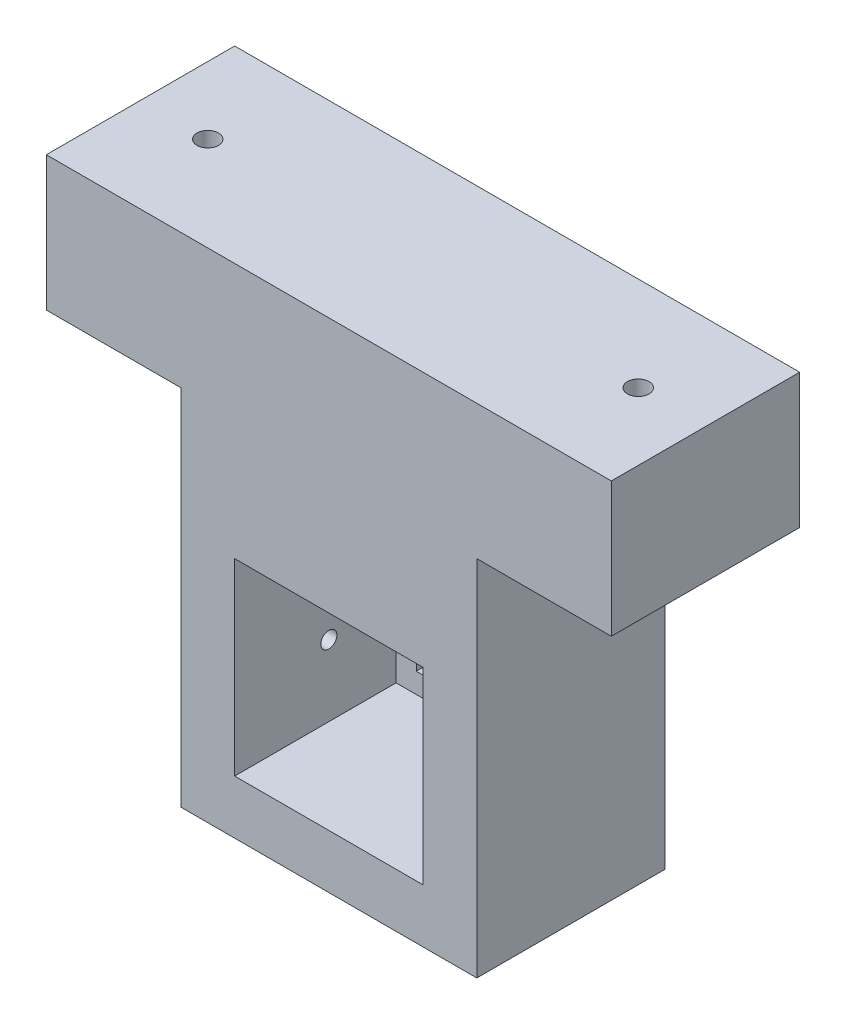
ISO-10303-21;
HEADER;
FILE_DESCRIPTION(('STEP AP214'),'2;1');
FILE_NAME('part.step','',(''),(''),'','','');
FILE_SCHEMA(('AUTOMOTIVE_DESIGN { 1 0 10303 214 1 1 1 1 }'));
ENDSEC;
DATA;
#1=APPLICATION_CONTEXT('core data for automotive mechanical design processes');
#2=APPLICATION_PROTOCOL_DEFINITION('international standard','automotive_design',2000,#1);
#3=PRODUCT_CONTEXT('',#1,'mechanical');
#4=PRODUCT('Part','Part','',(#3));
#5=PRODUCT_RELATED_PRODUCT_CATEGORY('part','',(#4));
#6=PRODUCT_DEFINITION_FORMATION('','',#4);
#7=PRODUCT_DEFINITION_CONTEXT('part definition',#1,'design');
#8=PRODUCT_DEFINITION('design','',#6,#7);
#9=PRODUCT_DEFINITION_SHAPE('','',#8);
#10=(LENGTH_UNIT() NAMED_UNIT(*) SI_UNIT(.MILLI.,.METRE.));
#11=(NAMED_UNIT(*) PLANE_ANGLE_UNIT() SI_UNIT($,.RADIAN.));
#12=(NAMED_UNIT(*) SI_UNIT($,.STERADIAN.) SOLID_ANGLE_UNIT());
#13=UNCERTAINTY_MEASURE_WITH_UNIT(LENGTH_MEASURE(1.E-05),#10,'distance_accuracy_value','');
#14=(GEOMETRIC_REPRESENTATION_CONTEXT(3) GLOBAL_UNCERTAINTY_ASSIGNED_CONTEXT((#13)) GLOBAL_UNIT_ASSIGNED_CONTEXT((#10,
#11,#12)) REPRESENTATION_CONTEXT('',''));
#15=CARTESIAN_POINT('',(0.,0.,0.));
#16=DIRECTION('',(0.,0.,1.));
#17=DIRECTION('',(1.,0.,0.));
#18=AXIS2_PLACEMENT_3D('',#15,#16,#17);
#19=CARTESIAN_POINT('',(0.,0.,7.));
#20=DIRECTION('',(1.,0.,0.));
#21=DIRECTION('',(0.,0.,-1.));
#22=AXIS2_PLACEMENT_3D('',#19,#20,#21);
#23=PLANE('',#22);
#24=CARTESIAN_POINT('',(0.,4.64002852368139,3.5));
#25=DIRECTION('',(-1.,0.,0.));
#26=DIRECTION('',(0.,0.,1.));
#27=AXIS2_PLACEMENT_3D('',#24,#25,#26);
#28=CIRCLE('',#27,0.3);
#29=CARTESIAN_POINT('',(0.,4.64002852368139,3.8));
#30=VERTEX_POINT('',#29);
#31=EDGE_CURVE('E192',#30,#30,#28,.T.);
#32=ORIENTED_EDGE('',*,*,#31,.F.);
#33=EDGE_LOOP('',(#32));
#34=FACE_BOUND('',#33,.T.);
#35=DIRECTION('',(0.,0.,1.));
#36=VECTOR('',#35,1.);
#37=CARTESIAN_POINT('',(0.,13.5,0.));
#38=LINE('',#37,#36);
#39=CARTESIAN_POINT('',(0.,13.5,0.));
#40=VERTEX_POINT('',#39);
#41=CARTESIAN_POINT('',(0.,13.5,7.));
#42=VERTEX_POINT('',#41);
#43=EDGE_CURVE('E49',#40,#42,#38,.T.);
#44=ORIENTED_EDGE('',*,*,#43,.F.);
#45=DIRECTION('',(0.,-1.,0.));
#46=VECTOR('',#45,1.);
#47=CARTESIAN_POINT('',(0.,0.,0.));
#48=LINE('',#47,#46);
#49=CARTESIAN_POINT('',(0.,0.,0.));
#50=VERTEX_POINT('',#49);
#51=EDGE_CURVE('E169',#40,#50,#48,.T.);
#52=ORIENTED_EDGE('',*,*,#51,.T.);
#53=DIRECTION('',(0.,0.,-1.));
#54=VECTOR('',#53,1.);
#55=CARTESIAN_POINT('',(0.,0.,7.));
#56=LINE('',#55,#54);
#57=CARTESIAN_POINT('',(0.,0.,7.));
#58=VERTEX_POINT('',#57);
#59=EDGE_CURVE('E268',#58,#50,#56,.T.);
#60=ORIENTED_EDGE('',*,*,#59,.F.);
#61=DIRECTION('',(0.,-1.,0.));
#62=VECTOR('',#61,1.);
#63=CARTESIAN_POINT('',(0.,0.,7.));
#64=LINE('',#63,#62);
#65=EDGE_CURVE('E250',#42,#58,#64,.T.);
#66=ORIENTED_EDGE('',*,*,#65,.F.);
#67=EDGE_LOOP('',(#44,#52,#60,#66));
#68=FACE_BOUND('',#67,.T.);
#69=ADVANCED_FACE('F33',(#34,#68),#23,.F.);
#70=CARTESIAN_POINT('',(11.,0.,7.));
#71=DIRECTION('',(-1.,0.,0.));
#72=DIRECTION('',(0.,0.,1.));
#73=AXIS2_PLACEMENT_3D('',#70,#71,#72);
#74=PLANE('',#73);
#75=DIRECTION('',(0.,0.,-1.));
#76=VECTOR('',#75,1.);
#77=CARTESIAN_POINT('',(11.,13.5,7.));
#78=LINE('',#77,#76);
#79=CARTESIAN_POINT('',(11.,13.5,7.));
#80=VERTEX_POINT('',#79);
#81=CARTESIAN_POINT('',(11.,13.5,0.));
#82=VERTEX_POINT('',#81);
#83=EDGE_CURVE('E57',#80,#82,#78,.T.);
#84=ORIENTED_EDGE('',*,*,#83,.F.);
#85=DIRECTION('',(0.,1.,0.));
#86=VECTOR('',#85,1.);
#87=CARTESIAN_POINT('',(11.,0.,7.));
#88=LINE('',#87,#86);
#89=CARTESIAN_POINT('',(11.,0.,7.));
#90=VERTEX_POINT('',#89);
#91=EDGE_CURVE('E255',#90,#80,#88,.T.);
#92=ORIENTED_EDGE('',*,*,#91,.F.);
#93=DIRECTION('',(0.,0.,-1.));
#94=VECTOR('',#93,1.);
#95=CARTESIAN_POINT('',(11.,0.,7.));
#96=LINE('',#95,#94);
#97=CARTESIAN_POINT('',(11.,0.,0.));
#98=VERTEX_POINT('',#97);
#99=EDGE_CURVE('E259',#90,#98,#96,.T.);
#100=ORIENTED_EDGE('',*,*,#99,.T.);
#101=DIRECTION('',(0.,1.,0.));
#102=VECTOR('',#101,1.);
#103=CARTESIAN_POINT('',(11.,0.,0.));
#104=LINE('',#103,#102);
#105=EDGE_CURVE('E263',#98,#82,#104,.T.);
#106=ORIENTED_EDGE('',*,*,#105,.T.);
#107=EDGE_LOOP('',(#84,#92,#100,#106));
#108=FACE_BOUND('',#107,.T.);
#109=ADVANCED_FACE('F306',(#108),#74,.F.);
#110=CARTESIAN_POINT('',(0.,0.,7.));
#111=DIRECTION('',(0.,1.,0.));
#112=DIRECTION('',(0.,0.,1.));
#113=AXIS2_PLACEMENT_3D('',#110,#111,#112);
#114=PLANE('',#113);
#115=DIRECTION('',(1.,0.,0.));
#116=VECTOR('',#115,1.);
#117=CARTESIAN_POINT('',(0.,0.,0.));
#118=LINE('',#117,#116);
#119=EDGE_CURVE('E261',#50,#98,#118,.T.);
#120=ORIENTED_EDGE('',*,*,#119,.T.);
#121=ORIENTED_EDGE('',*,*,#99,.F.);
#122=DIRECTION('',(1.,0.,0.));
#123=VECTOR('',#122,1.);
#124=CARTESIAN_POINT('',(0.,0.,7.));
#125=LINE('',#124,#123);
#126=EDGE_CURVE('E252',#58,#90,#125,.T.);
#127=ORIENTED_EDGE('',*,*,#126,.F.);
#128=ORIENTED_EDGE('',*,*,#59,.T.);
#129=EDGE_LOOP('',(#120,#121,#127,#128));
#130=FACE_BOUND('',#129,.T.);
#131=ADVANCED_FACE('F309',(#130),#114,.F.);
#132=CARTESIAN_POINT('',(0.,18.5,7.));
#133=DIRECTION('',(0.,-1.,0.));
#134=DIRECTION('',(0.,0.,-1.));
#135=AXIS2_PLACEMENT_3D('',#132,#133,#134);
#136=PLANE('',#135);
#137=CARTESIAN_POINT('',(-2.5,18.5,3.5));
#138=DIRECTION('',(0.,1.,0.));
#139=DIRECTION('',(0.,0.,1.));
#140=AXIS2_PLACEMENT_3D('',#137,#138,#139);
#141=CIRCLE('',#140,0.4);
#142=CARTESIAN_POINT('',(-2.5,18.5,3.9));
#143=VERTEX_POINT('',#142);
#144=EDGE_CURVE('E278',#143,#143,#141,.T.);
#145=ORIENTED_EDGE('',*,*,#144,.F.);
#146=EDGE_LOOP('',(#145));
#147=FACE_BOUND('',#146,.T.);
#148=CARTESIAN_POINT('',(13.5,18.5,3.5));
#149=DIRECTION('',(0.,1.,0.));
#150=DIRECTION('',(0.,0.,1.));
#151=AXIS2_PLACEMENT_3D('',#148,#149,#150);
#152=CIRCLE('',#151,0.399999999999999);
#153=CARTESIAN_POINT('',(13.5,18.5,3.9));
#154=VERTEX_POINT('',#153);
#155=EDGE_CURVE('E283',#154,#154,#152,.T.);
#156=ORIENTED_EDGE('',*,*,#155,.F.);
#157=EDGE_LOOP('',(#156));
#158=FACE_BOUND('',#157,.T.);
#159=DIRECTION('',(-1.,0.,0.));
#160=VECTOR('',#159,1.);
#161=CARTESIAN_POINT('',(0.,18.5,0.));
#162=LINE('',#161,#160);
#163=CARTESIAN_POINT('',(16.,18.5,0.));
#164=VERTEX_POINT('',#163);
#165=CARTESIAN_POINT('',(-5.,18.5,0.));
#166=VERTEX_POINT('',#165);
#167=EDGE_CURVE('E253',#164,#166,#162,.T.);
#168=ORIENTED_EDGE('',*,*,#167,.T.);
#169=DIRECTION('',(0.,0.,-1.));
#170=VECTOR('',#169,1.);
#171=CARTESIAN_POINT('',(-5.,18.5,7.));
#172=LINE('',#171,#170);
#173=CARTESIAN_POINT('',(-5.,18.5,7.));
#174=VERTEX_POINT('',#173);
#175=EDGE_CURVE('E164',#174,#166,#172,.T.);
#176=ORIENTED_EDGE('',*,*,#175,.F.);
#177=DIRECTION('',(-1.,0.,0.));
#178=VECTOR('',#177,1.);
#179=CARTESIAN_POINT('',(0.,18.5,7.));
#180=LINE('',#179,#178);
#181=CARTESIAN_POINT('',(16.,18.5,7.));
#182=VERTEX_POINT('',#181);
#183=EDGE_CURVE('E257',#182,#174,#180,.T.);
#184=ORIENTED_EDGE('',*,*,#183,.F.);
#185=DIRECTION('',(0.,0.,1.));
#186=VECTOR('',#185,1.);
#187=CARTESIAN_POINT('',(16.,18.5,0.));
#188=LINE('',#187,#186);
#189=EDGE_CURVE('E183',#164,#182,#188,.T.);
#190=ORIENTED_EDGE('',*,*,#189,.F.);
#191=EDGE_LOOP('',(#168,#176,#184,#190));
#192=FACE_BOUND('',#191,.T.);
#193=ADVANCED_FACE('F296',(#147,#158,#192),#136,.F.);
#194=CARTESIAN_POINT('',(0.,0.,7.));
#195=DIRECTION('',(0.,0.,-1.));
#196=DIRECTION('',(-1.,0.,0.));
#197=AXIS2_PLACEMENT_3D('',#194,#195,#196);
#198=PLANE('',#197);
#199=DIRECTION('',(1.,0.,0.));
#200=VECTOR('',#199,1.);
#201=CARTESIAN_POINT('',(2.,2.,7.));
#202=LINE('',#201,#200);
#203=CARTESIAN_POINT('',(2.,2.,7.));
#204=VERTEX_POINT('',#203);
#205=CARTESIAN_POINT('',(9.,2.,7.));
#206=VERTEX_POINT('',#205);
#207=EDGE_CURVE('E234',#204,#206,#202,.T.);
#208=ORIENTED_EDGE('',*,*,#207,.F.);
#209=DIRECTION('',(0.,-1.,0.));
#210=VECTOR('',#209,1.);
#211=CARTESIAN_POINT('',(2.,9.,7.));
#212=LINE('',#211,#210);
#213=CARTESIAN_POINT('',(2.,9.,7.));
#214=VERTEX_POINT('',#213);
#215=EDGE_CURVE('E212',#214,#204,#212,.T.);
#216=ORIENTED_EDGE('',*,*,#215,.F.);
#217=DIRECTION('',(-1.,0.,0.));
#218=VECTOR('',#217,1.);
#219=CARTESIAN_POINT('',(2.,9.,7.));
#220=LINE('',#219,#218);
#221=CARTESIAN_POINT('',(9.,9.,7.));
#222=VERTEX_POINT('',#221);
#223=EDGE_CURVE('E223',#222,#214,#220,.T.);
#224=ORIENTED_EDGE('',*,*,#223,.F.);
#225=DIRECTION('',(0.,1.,0.));
#226=VECTOR('',#225,1.);
#227=CARTESIAN_POINT('',(9.,9.,7.));
#228=LINE('',#227,#226);
#229=EDGE_CURVE('E237',#206,#222,#228,.T.);
#230=ORIENTED_EDGE('',*,*,#229,.F.);
#231=EDGE_LOOP('',(#208,#216,#224,#230));
#232=FACE_BOUND('',#231,.T.);
#233=ORIENTED_EDGE('',*,*,#183,.T.);
#234=DIRECTION('',(0.,1.,0.));
#235=VECTOR('',#234,1.);
#236=CARTESIAN_POINT('',(-5.,13.5,7.));
#237=LINE('',#236,#235);
#238=CARTESIAN_POINT('',(-5.,13.5,7.));
#239=VERTEX_POINT('',#238);
#240=EDGE_CURVE('E157',#239,#174,#237,.T.);
#241=ORIENTED_EDGE('',*,*,#240,.F.);
#242=DIRECTION('',(1.,0.,0.));
#243=VECTOR('',#242,1.);
#244=CARTESIAN_POINT('',(-5.,13.5,7.));
#245=LINE('',#244,#243);
#246=EDGE_CURVE('E153',#239,#42,#245,.T.);
#247=ORIENTED_EDGE('',*,*,#246,.T.);
#248=ORIENTED_EDGE('',*,*,#65,.T.);
#249=ORIENTED_EDGE('',*,*,#126,.T.);
#250=ORIENTED_EDGE('',*,*,#91,.T.);
#251=DIRECTION('',(-1.,0.,0.));
#252=VECTOR('',#251,1.);
#253=CARTESIAN_POINT('',(16.,13.5,7.));
#254=LINE('',#253,#252);
#255=CARTESIAN_POINT('',(16.,13.5,7.));
#256=VERTEX_POINT('',#255);
#257=EDGE_CURVE('E189',#256,#80,#254,.T.);
#258=ORIENTED_EDGE('',*,*,#257,.F.);
#259=DIRECTION('',(0.,-1.,0.));
#260=VECTOR('',#259,1.);
#261=CARTESIAN_POINT('',(16.,18.5,7.));
#262=LINE('',#261,#260);
#263=EDGE_CURVE('E171',#182,#256,#262,.T.);
#264=ORIENTED_EDGE('',*,*,#263,.F.);
#265=EDGE_LOOP('',(#233,#241,#247,#248,#249,#250,#258,#264));
#266=FACE_BOUND('',#265,.T.);
#267=ADVANCED_FACE('F292',(#232,#266),#198,.F.);
#268=CARTESIAN_POINT('',(0.,0.,0.));
#269=DIRECTION('',(0.,0.,-1.));
#270=DIRECTION('',(-1.,0.,0.));
#271=AXIS2_PLACEMENT_3D('',#268,#269,#270);
#272=PLANE('',#271);
#273=DIRECTION('',(0.,1.,0.));
#274=VECTOR('',#273,1.);
#275=CARTESIAN_POINT('',(2.75,0.,0.));
#276=LINE('',#275,#274);
#277=CARTESIAN_POINT('',(2.75,2.75,0.));
#278=VERTEX_POINT('',#277);
#279=CARTESIAN_POINT('',(2.75,8.25,0.));
#280=VERTEX_POINT('',#279);
#281=EDGE_CURVE('E11',#278,#280,#276,.T.);
#282=ORIENTED_EDGE('',*,*,#281,.F.);
#283=DIRECTION('',(-1.,0.,0.));
#284=VECTOR('',#283,1.);
#285=CARTESIAN_POINT('',(0.,2.75,0.));
#286=LINE('',#285,#284);
#287=CARTESIAN_POINT('',(8.25,2.75,0.));
#288=VERTEX_POINT('',#287);
#289=EDGE_CURVE('E271',#288,#278,#286,.T.);
#290=ORIENTED_EDGE('',*,*,#289,.F.);
#291=DIRECTION('',(0.,-1.,0.));
#292=VECTOR('',#291,1.);
#293=CARTESIAN_POINT('',(8.25,0.,0.));
#294=LINE('',#293,#292);
#295=CARTESIAN_POINT('',(8.25,8.25,0.));
#296=VERTEX_POINT('',#295);
#297=EDGE_CURVE('E273',#296,#288,#294,.T.);
#298=ORIENTED_EDGE('',*,*,#297,.F.);
#299=DIRECTION('',(1.,0.,0.));
#300=VECTOR('',#299,1.);
#301=CARTESIAN_POINT('',(0.,8.25,0.));
#302=LINE('',#301,#300);
#303=EDGE_CURVE('E41',#280,#296,#302,.T.);
#304=ORIENTED_EDGE('',*,*,#303,.F.);
#305=EDGE_LOOP('',(#282,#290,#298,#304));
#306=FACE_BOUND('',#305,.T.);
#307=ORIENTED_EDGE('',*,*,#51,.F.);
#308=DIRECTION('',(1.,0.,0.));
#309=VECTOR('',#308,1.);
#310=CARTESIAN_POINT('',(-5.,13.5,0.));
#311=LINE('',#310,#309);
#312=CARTESIAN_POINT('',(-5.,13.5,0.));
#313=VERTEX_POINT('',#312);
#314=EDGE_CURVE('E151',#313,#40,#311,.T.);
#315=ORIENTED_EDGE('',*,*,#314,.F.);
#316=DIRECTION('',(0.,-1.,0.));
#317=VECTOR('',#316,1.);
#318=CARTESIAN_POINT('',(-5.,18.5,0.));
#319=LINE('',#318,#317);
#320=EDGE_CURVE('E158',#166,#313,#319,.T.);
#321=ORIENTED_EDGE('',*,*,#320,.F.);
#322=ORIENTED_EDGE('',*,*,#167,.F.);
#323=DIRECTION('',(0.,1.,0.));
#324=VECTOR('',#323,1.);
#325=CARTESIAN_POINT('',(16.,13.5,0.));
#326=LINE('',#325,#324);
#327=CARTESIAN_POINT('',(16.,13.5,0.));
#328=VERTEX_POINT('',#327);
#329=EDGE_CURVE('E180',#328,#164,#326,.T.);
#330=ORIENTED_EDGE('',*,*,#329,.F.);
#331=DIRECTION('',(-1.,0.,0.));
#332=VECTOR('',#331,1.);
#333=CARTESIAN_POINT('',(16.,13.5,0.));
#334=LINE('',#333,#332);
#335=EDGE_CURVE('E185',#328,#82,#334,.T.);
#336=ORIENTED_EDGE('',*,*,#335,.T.);
#337=ORIENTED_EDGE('',*,*,#105,.F.);
#338=ORIENTED_EDGE('',*,*,#119,.F.);
#339=EDGE_LOOP('',(#307,#315,#321,#322,#330,#336,#337,#338));
#340=FACE_BOUND('',#339,.T.);
#341=ADVANCED_FACE('F167',(#306,#340),#272,.T.);
#342=CARTESIAN_POINT('',(2.,9.,1.));
#343=DIRECTION('',(-1.,0.,0.));
#344=DIRECTION('',(0.,-1.,0.));
#345=AXIS2_PLACEMENT_3D('',#342,#343,#344);
#346=PLANE('',#345);
#347=CARTESIAN_POINT('',(2.,4.64002852368139,3.5));
#348=DIRECTION('',(-1.,0.,0.));
#349=DIRECTION('',(0.,-1.,0.));
#350=AXIS2_PLACEMENT_3D('',#347,#348,#349);
#351=CIRCLE('',#350,0.3);
#352=CARTESIAN_POINT('',(2.,4.34002852368139,3.5));
#353=VERTEX_POINT('',#352);
#354=EDGE_CURVE('E195',#353,#353,#351,.F.);
#355=ORIENTED_EDGE('',*,*,#354,.F.);
#356=EDGE_LOOP('',(#355));
#357=FACE_BOUND('',#356,.T.);
#358=ORIENTED_EDGE('',*,*,#215,.T.);
#359=DIRECTION('',(0.,0.,1.));
#360=VECTOR('',#359,1.);
#361=CARTESIAN_POINT('',(2.,2.,1.));
#362=LINE('',#361,#360);
#363=CARTESIAN_POINT('',(2.,2.,1.));
#364=VERTEX_POINT('',#363);
#365=EDGE_CURVE('E232',#364,#204,#362,.T.);
#366=ORIENTED_EDGE('',*,*,#365,.F.);
#367=DIRECTION('',(0.,-1.,0.));
#368=VECTOR('',#367,1.);
#369=CARTESIAN_POINT('',(2.,9.,1.));
#370=LINE('',#369,#368);
#371=CARTESIAN_POINT('',(2.,9.,1.));
#372=VERTEX_POINT('',#371);
#373=EDGE_CURVE('E219',#372,#364,#370,.T.);
#374=ORIENTED_EDGE('',*,*,#373,.F.);
#375=DIRECTION('',(0.,0.,1.));
#376=VECTOR('',#375,1.);
#377=CARTESIAN_POINT('',(2.,9.,1.));
#378=LINE('',#377,#376);
#379=EDGE_CURVE('E242',#372,#214,#378,.T.);
#380=ORIENTED_EDGE('',*,*,#379,.T.);
#381=EDGE_LOOP('',(#358,#366,#374,#380));
#382=FACE_BOUND('',#381,.T.);
#383=ADVANCED_FACE('F326',(#357,#382),#346,.F.);
#384=CARTESIAN_POINT('',(2.,9.,1.));
#385=DIRECTION('',(0.,1.,0.));
#386=DIRECTION('',(0.,0.,1.));
#387=AXIS2_PLACEMENT_3D('',#384,#385,#386);
#388=PLANE('',#387);
#389=ORIENTED_EDGE('',*,*,#223,.T.);
#390=ORIENTED_EDGE('',*,*,#379,.F.);
#391=DIRECTION('',(-1.,0.,0.));
#392=VECTOR('',#391,1.);
#393=CARTESIAN_POINT('',(2.,9.,1.));
#394=LINE('',#393,#392);
#395=CARTESIAN_POINT('',(9.,9.,1.));
#396=VERTEX_POINT('',#395);
#397=EDGE_CURVE('E229',#396,#372,#394,.T.);
#398=ORIENTED_EDGE('',*,*,#397,.F.);
#399=DIRECTION('',(0.,0.,1.));
#400=VECTOR('',#399,1.);
#401=CARTESIAN_POINT('',(9.,9.,1.));
#402=LINE('',#401,#400);
#403=EDGE_CURVE('E244',#396,#222,#402,.T.);
#404=ORIENTED_EDGE('',*,*,#403,.T.);
#405=EDGE_LOOP('',(#389,#390,#398,#404));
#406=FACE_BOUND('',#405,.T.);
#407=ADVANCED_FACE('F329',(#406),#388,.F.);
#408=CARTESIAN_POINT('',(9.,9.,1.));
#409=DIRECTION('',(1.,0.,0.));
#410=DIRECTION('',(0.,0.,-1.));
#411=AXIS2_PLACEMENT_3D('',#408,#409,#410);
#412=PLANE('',#411);
#413=ORIENTED_EDGE('',*,*,#229,.T.);
#414=ORIENTED_EDGE('',*,*,#403,.F.);
#415=DIRECTION('',(0.,1.,0.));
#416=VECTOR('',#415,1.);
#417=CARTESIAN_POINT('',(9.,9.,1.));
#418=LINE('',#417,#416);
#419=CARTESIAN_POINT('',(9.,2.,1.));
#420=VERTEX_POINT('',#419);
#421=EDGE_CURVE('E226',#420,#396,#418,.T.);
#422=ORIENTED_EDGE('',*,*,#421,.F.);
#423=DIRECTION('',(0.,0.,1.));
#424=VECTOR('',#423,1.);
#425=CARTESIAN_POINT('',(9.,2.,1.));
#426=LINE('',#425,#424);
#427=EDGE_CURVE('E246',#420,#206,#426,.T.);
#428=ORIENTED_EDGE('',*,*,#427,.T.);
#429=EDGE_LOOP('',(#413,#414,#422,#428));
#430=FACE_BOUND('',#429,.T.);
#431=ADVANCED_FACE('F341',(#430),#412,.F.);
#432=CARTESIAN_POINT('',(2.,2.,1.));
#433=DIRECTION('',(0.,-1.,0.));
#434=DIRECTION('',(0.,0.,-1.));
#435=AXIS2_PLACEMENT_3D('',#432,#433,#434);
#436=PLANE('',#435);
#437=ORIENTED_EDGE('',*,*,#207,.T.);
#438=ORIENTED_EDGE('',*,*,#427,.F.);
#439=DIRECTION('',(1.,0.,0.));
#440=VECTOR('',#439,1.);
#441=CARTESIAN_POINT('',(2.,2.,1.));
#442=LINE('',#441,#440);
#443=EDGE_CURVE('E222',#364,#420,#442,.T.);
#444=ORIENTED_EDGE('',*,*,#443,.F.);
#445=ORIENTED_EDGE('',*,*,#365,.T.);
#446=EDGE_LOOP('',(#437,#438,#444,#445));
#447=FACE_BOUND('',#446,.T.);
#448=ADVANCED_FACE('F338',(#447),#436,.F.);
#449=CARTESIAN_POINT('',(0.,0.,1.));
#450=DIRECTION('',(0.,0.,1.));
#451=DIRECTION('',(1.,0.,0.));
#452=AXIS2_PLACEMENT_3D('',#449,#450,#451);
#453=PLANE('',#452);
#454=DIRECTION('',(0.,-1.,0.));
#455=VECTOR('',#454,1.);
#456=CARTESIAN_POINT('',(2.75,8.25,1.));
#457=LINE('',#456,#455);
#458=CARTESIAN_POINT('',(2.75,8.25,1.));
#459=VERTEX_POINT('',#458);
#460=CARTESIAN_POINT('',(2.75,2.75,1.));
#461=VERTEX_POINT('',#460);
#462=EDGE_CURVE('E198',#459,#461,#457,.T.);
#463=ORIENTED_EDGE('',*,*,#462,.F.);
#464=DIRECTION('',(-1.,0.,0.));
#465=VECTOR('',#464,1.);
#466=CARTESIAN_POINT('',(2.75,8.25,1.));
#467=LINE('',#466,#465);
#468=CARTESIAN_POINT('',(8.25,8.25,1.));
#469=VERTEX_POINT('',#468);
#470=EDGE_CURVE('E206',#469,#459,#467,.T.);
#471=ORIENTED_EDGE('',*,*,#470,.F.);
#472=DIRECTION('',(0.,1.,0.));
#473=VECTOR('',#472,1.);
#474=CARTESIAN_POINT('',(8.25,8.25,1.));
#475=LINE('',#474,#473);
#476=CARTESIAN_POINT('',(8.25,2.75,1.));
#477=VERTEX_POINT('',#476);
#478=EDGE_CURVE('E204',#477,#469,#475,.T.);
#479=ORIENTED_EDGE('',*,*,#478,.F.);
#480=DIRECTION('',(1.,0.,0.));
#481=VECTOR('',#480,1.);
#482=CARTESIAN_POINT('',(2.75,2.75,1.));
#483=LINE('',#482,#481);
#484=EDGE_CURVE('E201',#461,#477,#483,.T.);
#485=ORIENTED_EDGE('',*,*,#484,.F.);
#486=EDGE_LOOP('',(#463,#471,#479,#485));
#487=FACE_BOUND('',#486,.T.);
#488=ORIENTED_EDGE('',*,*,#373,.T.);
#489=ORIENTED_EDGE('',*,*,#443,.T.);
#490=ORIENTED_EDGE('',*,*,#421,.T.);
#491=ORIENTED_EDGE('',*,*,#397,.T.);
#492=EDGE_LOOP('',(#488,#489,#490,#491));
#493=FACE_BOUND('',#492,.T.);
#494=ADVANCED_FACE('F345',(#487,#493),#453,.T.);
#495=CARTESIAN_POINT('',(2.75,8.25,-9.));
#496=DIRECTION('',(-1.,0.,0.));
#497=DIRECTION('',(0.,-1.,0.));
#498=AXIS2_PLACEMENT_3D('',#495,#496,#497);
#499=PLANE('',#498);
#500=ORIENTED_EDGE('',*,*,#281,.T.);
#501=DIRECTION('',(0.,0.,1.));
#502=VECTOR('',#501,1.);
#503=CARTESIAN_POINT('',(2.75,8.25,-9.));
#504=LINE('',#503,#502);
#505=EDGE_CURVE('E210',#280,#459,#504,.T.);
#506=ORIENTED_EDGE('',*,*,#505,.T.);
#507=ORIENTED_EDGE('',*,*,#462,.T.);
#508=DIRECTION('',(0.,0.,1.));
#509=VECTOR('',#508,1.);
#510=CARTESIAN_POINT('',(2.75,2.75,-9.));
#511=LINE('',#510,#509);
#512=EDGE_CURVE('E209',#278,#461,#511,.T.);
#513=ORIENTED_EDGE('',*,*,#512,.F.);
#514=EDGE_LOOP('',(#500,#506,#507,#513));
#515=FACE_BOUND('',#514,.T.);
#516=ADVANCED_FACE('F482',(#515),#499,.F.);
#517=CARTESIAN_POINT('',(2.75,8.25,-9.));
#518=DIRECTION('',(0.,1.,0.));
#519=DIRECTION('',(-1.,0.,0.));
#520=AXIS2_PLACEMENT_3D('',#517,#518,#519);
#521=PLANE('',#520);
#522=ORIENTED_EDGE('',*,*,#303,.T.);
#523=DIRECTION('',(0.,0.,1.));
#524=VECTOR('',#523,1.);
#525=CARTESIAN_POINT('',(8.25,8.25,-9.));
#526=LINE('',#525,#524);
#527=EDGE_CURVE('E213',#296,#469,#526,.T.);
#528=ORIENTED_EDGE('',*,*,#527,.T.);
#529=ORIENTED_EDGE('',*,*,#470,.T.);
#530=ORIENTED_EDGE('',*,*,#505,.F.);
#531=EDGE_LOOP('',(#522,#528,#529,#530));
#532=FACE_BOUND('',#531,.T.);
#533=ADVANCED_FACE('F478',(#532),#521,.F.);
#534=CARTESIAN_POINT('',(8.25,8.25,-9.));
#535=DIRECTION('',(1.,0.,0.));
#536=DIRECTION('',(0.,0.,-1.));
#537=AXIS2_PLACEMENT_3D('',#534,#535,#536);
#538=PLANE('',#537);
#539=ORIENTED_EDGE('',*,*,#297,.T.);
#540=DIRECTION('',(0.,0.,1.));
#541=VECTOR('',#540,1.);
#542=CARTESIAN_POINT('',(8.25,2.75,-9.));
#543=LINE('',#542,#541);
#544=EDGE_CURVE('E216',#288,#477,#543,.T.);
#545=ORIENTED_EDGE('',*,*,#544,.T.);
#546=ORIENTED_EDGE('',*,*,#478,.T.);
#547=ORIENTED_EDGE('',*,*,#527,.F.);
#548=EDGE_LOOP('',(#539,#545,#546,#547));
#549=FACE_BOUND('',#548,.T.);
#550=ADVANCED_FACE('F481',(#549),#538,.F.);
#551=CARTESIAN_POINT('',(2.75,2.75,-9.));
#552=DIRECTION('',(0.,-1.,0.));
#553=DIRECTION('',(0.,0.,-1.));
#554=AXIS2_PLACEMENT_3D('',#551,#552,#553);
#555=PLANE('',#554);
#556=ORIENTED_EDGE('',*,*,#289,.T.);
#557=ORIENTED_EDGE('',*,*,#512,.T.);
#558=ORIENTED_EDGE('',*,*,#484,.T.);
#559=ORIENTED_EDGE('',*,*,#544,.F.);
#560=EDGE_LOOP('',(#556,#557,#558,#559));
#561=FACE_BOUND('',#560,.T.);
#562=ADVANCED_FACE('F322',(#561),#555,.F.);
#563=CARTESIAN_POINT('',(11.001,4.64002852368139,3.5));
#564=DIRECTION('',(-1.,0.,0.));
#565=DIRECTION('',(0.,0.,1.));
#566=AXIS2_PLACEMENT_3D('',#563,#564,#565);
#567=CYLINDRICAL_SURFACE('',#566,0.3);
#568=ORIENTED_EDGE('',*,*,#31,.T.);
#569=EDGE_LOOP('',(#568));
#570=FACE_BOUND('',#569,.T.);
#571=ORIENTED_EDGE('',*,*,#354,.T.);
#572=EDGE_LOOP('',(#571));
#573=FACE_BOUND('',#572,.T.);
#574=ADVANCED_FACE('F319',(#570,#573),#567,.F.);
#575=CARTESIAN_POINT('',(16.,13.5,7.));
#576=DIRECTION('',(0.,1.,0.));
#577=DIRECTION('',(0.,0.,1.));
#578=AXIS2_PLACEMENT_3D('',#575,#576,#577);
#579=PLANE('',#578);
#580=CARTESIAN_POINT('',(13.5,13.5,3.5));
#581=DIRECTION('',(0.,1.,0.));
#582=DIRECTION('',(0.,0.,1.));
#583=AXIS2_PLACEMENT_3D('',#580,#581,#582);
#584=CIRCLE('',#583,0.399999999999999);
#585=CARTESIAN_POINT('',(13.5,13.5,3.9));
#586=VERTEX_POINT('',#585);
#587=EDGE_CURVE('E36',#586,#586,#584,.T.);
#588=ORIENTED_EDGE('',*,*,#587,.T.);
#589=EDGE_LOOP('',(#588));
#590=FACE_BOUND('',#589,.T.);
#591=ORIENTED_EDGE('',*,*,#83,.T.);
#592=ORIENTED_EDGE('',*,*,#335,.F.);
#593=DIRECTION('',(0.,0.,-1.));
#594=VECTOR('',#593,1.);
#595=CARTESIAN_POINT('',(16.,13.5,7.));
#596=LINE('',#595,#594);
#597=EDGE_CURVE('E178',#256,#328,#596,.T.);
#598=ORIENTED_EDGE('',*,*,#597,.F.);
#599=ORIENTED_EDGE('',*,*,#257,.T.);
#600=EDGE_LOOP('',(#591,#592,#598,#599));
#601=FACE_BOUND('',#600,.T.);
#602=ADVANCED_FACE('F304',(#590,#601),#579,.F.);
#603=CARTESIAN_POINT('',(16.,0.,0.));
#604=DIRECTION('',(1.,0.,0.));
#605=DIRECTION('',(0.,0.,-1.));
#606=AXIS2_PLACEMENT_3D('',#603,#604,#605);
#607=PLANE('',#606);
#608=ORIENTED_EDGE('',*,*,#263,.T.);
#609=ORIENTED_EDGE('',*,*,#597,.T.);
#610=ORIENTED_EDGE('',*,*,#329,.T.);
#611=ORIENTED_EDGE('',*,*,#189,.T.);
#612=EDGE_LOOP('',(#608,#609,#610,#611));
#613=FACE_BOUND('',#612,.T.);
#614=ADVANCED_FACE('F300',(#613),#607,.T.);
#615=CARTESIAN_POINT('',(-5.,13.5,0.));
#616=DIRECTION('',(0.,1.,0.));
#617=DIRECTION('',(0.,0.,1.));
#618=AXIS2_PLACEMENT_3D('',#615,#616,#617);
#619=PLANE('',#618);
#620=CARTESIAN_POINT('',(-2.5,13.5,3.5));
#621=DIRECTION('',(0.,1.,0.));
#622=DIRECTION('',(0.,0.,1.));
#623=AXIS2_PLACEMENT_3D('',#620,#621,#622);
#624=CIRCLE('',#623,0.4);
#625=CARTESIAN_POINT('',(-2.5,13.5,3.9));
#626=VERTEX_POINT('',#625);
#627=EDGE_CURVE('E276',#626,#626,#624,.T.);
#628=ORIENTED_EDGE('',*,*,#627,.T.);
#629=EDGE_LOOP('',(#628));
#630=FACE_BOUND('',#629,.T.);
#631=ORIENTED_EDGE('',*,*,#43,.T.);
#632=ORIENTED_EDGE('',*,*,#246,.F.);
#633=DIRECTION('',(0.,0.,1.));
#634=VECTOR('',#633,1.);
#635=CARTESIAN_POINT('',(-5.,13.5,0.));
#636=LINE('',#635,#634);
#637=EDGE_CURVE('E147',#313,#239,#636,.T.);
#638=ORIENTED_EDGE('',*,*,#637,.F.);
#639=ORIENTED_EDGE('',*,*,#314,.T.);
#640=EDGE_LOOP('',(#631,#632,#638,#639));
#641=FACE_BOUND('',#640,.T.);
#642=ADVANCED_FACE('F149',(#630,#641),#619,.F.);
#643=CARTESIAN_POINT('',(-5.,0.,0.));
#644=DIRECTION('',(-1.,0.,0.));
#645=DIRECTION('',(0.,0.,1.));
#646=AXIS2_PLACEMENT_3D('',#643,#644,#645);
#647=PLANE('',#646);
#648=ORIENTED_EDGE('',*,*,#320,.T.);
#649=ORIENTED_EDGE('',*,*,#637,.T.);
#650=ORIENTED_EDGE('',*,*,#240,.T.);
#651=ORIENTED_EDGE('',*,*,#175,.T.);
#652=EDGE_LOOP('',(#648,#649,#650,#651));
#653=FACE_BOUND('',#652,.T.);
#654=ADVANCED_FACE('F162',(#653),#647,.T.);
#655=CARTESIAN_POINT('',(-2.5,0.,3.5));
#656=DIRECTION('',(0.,1.,0.));
#657=DIRECTION('',(0.,0.,1.));
#658=AXIS2_PLACEMENT_3D('',#655,#656,#657);
#659=CYLINDRICAL_SURFACE('',#658,0.4);
#660=ORIENTED_EDGE('',*,*,#144,.T.);
#661=EDGE_LOOP('',(#660));
#662=FACE_BOUND('',#661,.T.);
#663=ORIENTED_EDGE('',*,*,#627,.F.);
#664=EDGE_LOOP('',(#663));
#665=FACE_BOUND('',#664,.T.);
#666=ADVANCED_FACE('F453',(#662,#665),#659,.F.);
#667=CARTESIAN_POINT('',(13.5,0.,3.5));
#668=DIRECTION('',(0.,1.,0.));
#669=DIRECTION('',(0.,0.,1.));
#670=AXIS2_PLACEMENT_3D('',#667,#668,#669);
#671=CYLINDRICAL_SURFACE('',#670,0.399999999999999);
#672=ORIENTED_EDGE('',*,*,#155,.T.);
#673=EDGE_LOOP('',(#672));
#674=FACE_BOUND('',#673,.T.);
#675=ORIENTED_EDGE('',*,*,#587,.F.);
#676=EDGE_LOOP('',(#675));
#677=FACE_BOUND('',#676,.T.);
#678=ADVANCED_FACE('F460',(#674,#677),#671,.F.);
#679=CLOSED_SHELL('',(#69,#109,#131,#193,#267,#341,#383,#407,#431,#448,#494,#516,#533,#550,#562,
#574,#602,#614,#642,#654,#666,#678));
#680=MANIFOLD_SOLID_BREP('B2',#679);
#681=ADVANCED_BREP_SHAPE_REPRESENTATION('',(#18,#680),#14);
#682=SHAPE_DEFINITION_REPRESENTATION(#9,#681);
ENDSEC;
END-ISO-10303-21;
